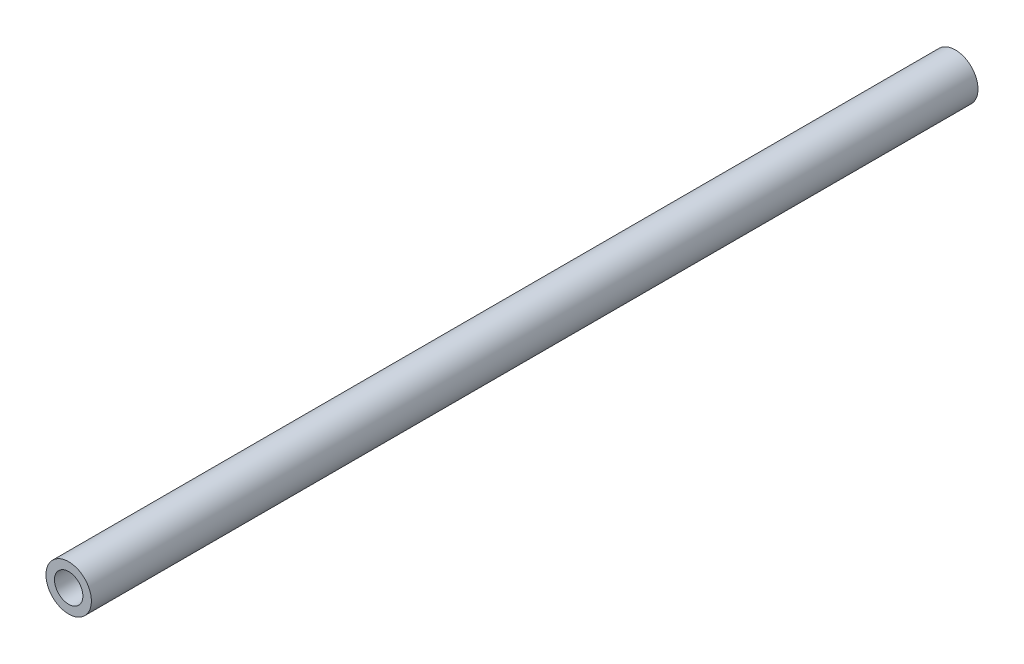
ISO-10303-21;
HEADER;
FILE_DESCRIPTION(('STEP AP214'),'2;1');
FILE_NAME('part.step','',(''),(''),'','','');
FILE_SCHEMA(('AUTOMOTIVE_DESIGN { 1 0 10303 214 1 1 1 1 }'));
ENDSEC;
DATA;
#1=APPLICATION_CONTEXT('core data for automotive mechanical design processes');
#2=APPLICATION_PROTOCOL_DEFINITION('international standard','automotive_design',2000,#1);
#3=PRODUCT_CONTEXT('',#1,'mechanical');
#4=PRODUCT('Part','Part','',(#3));
#5=PRODUCT_RELATED_PRODUCT_CATEGORY('part','',(#4));
#6=PRODUCT_DEFINITION_FORMATION('','',#4);
#7=PRODUCT_DEFINITION_CONTEXT('part definition',#1,'design');
#8=PRODUCT_DEFINITION('design','',#6,#7);
#9=PRODUCT_DEFINITION_SHAPE('','',#8);
#10=(LENGTH_UNIT() NAMED_UNIT(*) SI_UNIT(.MILLI.,.METRE.));
#11=(NAMED_UNIT(*) PLANE_ANGLE_UNIT() SI_UNIT($,.RADIAN.));
#12=(NAMED_UNIT(*) SI_UNIT($,.STERADIAN.) SOLID_ANGLE_UNIT());
#13=UNCERTAINTY_MEASURE_WITH_UNIT(LENGTH_MEASURE(1.E-05),#10,'distance_accuracy_value','');
#14=(GEOMETRIC_REPRESENTATION_CONTEXT(3) GLOBAL_UNCERTAINTY_ASSIGNED_CONTEXT((#13)) GLOBAL_UNIT_ASSIGNED_CONTEXT((#10,
#11,#12)) REPRESENTATION_CONTEXT('',''));
#15=CARTESIAN_POINT('',(0.,0.,0.));
#16=DIRECTION('',(0.,0.,1.));
#17=DIRECTION('',(1.,0.,0.));
#18=AXIS2_PLACEMENT_3D('',#15,#16,#17);
#19=CARTESIAN_POINT('',(0.,0.,61.976));
#20=DIRECTION('',(0.,0.,-1.));
#21=DIRECTION('',(-1.,0.,0.));
#22=AXIS2_PLACEMENT_3D('',#19,#20,#21);
#23=CYLINDRICAL_SURFACE('',#22,1.5875);
#24=CARTESIAN_POINT('',(0.,0.,61.976));
#25=DIRECTION('',(0.,0.,1.));
#26=DIRECTION('',(1.,0.,0.));
#27=AXIS2_PLACEMENT_3D('',#24,#25,#26);
#28=CIRCLE('',#27,1.5875);
#29=CARTESIAN_POINT('',(1.5875,0.,61.976));
#30=VERTEX_POINT('',#29);
#31=EDGE_CURVE('E10',#30,#30,#28,.T.);
#32=ORIENTED_EDGE('',*,*,#31,.F.);
#33=EDGE_LOOP('',(#32));
#34=FACE_BOUND('',#33,.T.);
#35=CARTESIAN_POINT('',(0.,0.,0.));
#36=DIRECTION('',(0.,0.,1.));
#37=DIRECTION('',(1.,0.,0.));
#38=AXIS2_PLACEMENT_3D('',#35,#36,#37);
#39=CIRCLE('',#38,1.5875);
#40=CARTESIAN_POINT('',(1.5875,0.,0.));
#41=VERTEX_POINT('',#40);
#42=EDGE_CURVE('E36',#41,#41,#39,.T.);
#43=ORIENTED_EDGE('',*,*,#42,.T.);
#44=EDGE_LOOP('',(#43));
#45=FACE_BOUND('',#44,.T.);
#46=ADVANCED_FACE('F33',(#34,#45),#23,.T.);
#47=CARTESIAN_POINT('',(0.,0.,61.976));
#48=DIRECTION('',(0.,0.,1.));
#49=DIRECTION('',(1.,0.,0.));
#50=AXIS2_PLACEMENT_3D('',#47,#48,#49);
#51=PLANE('',#50);
#52=CARTESIAN_POINT('',(0.,0.,61.976));
#53=DIRECTION('',(0.,0.,1.));
#54=DIRECTION('',(1.,0.,0.));
#55=AXIS2_PLACEMENT_3D('',#52,#53,#54);
#56=CIRCLE('',#55,0.9921875);
#57=CARTESIAN_POINT('',(0.9921875,0.,61.976));
#58=VERTEX_POINT('',#57);
#59=EDGE_CURVE('E47',#58,#58,#56,.T.);
#60=ORIENTED_EDGE('',*,*,#59,.F.);
#61=EDGE_LOOP('',(#60));
#62=FACE_BOUND('',#61,.T.);
#63=ORIENTED_EDGE('',*,*,#31,.T.);
#64=EDGE_LOOP('',(#63));
#65=FACE_BOUND('',#64,.T.);
#66=ADVANCED_FACE('F54',(#62,#65),#51,.T.);
#67=CARTESIAN_POINT('',(0.,0.,0.));
#68=DIRECTION('',(0.,0.,1.));
#69=DIRECTION('',(1.,0.,0.));
#70=AXIS2_PLACEMENT_3D('',#67,#68,#69);
#71=PLANE('',#70);
#72=CARTESIAN_POINT('',(0.,0.,0.));
#73=DIRECTION('',(0.,0.,1.));
#74=DIRECTION('',(1.,0.,0.));
#75=AXIS2_PLACEMENT_3D('',#72,#73,#74);
#76=CIRCLE('',#75,0.9921875);
#77=CARTESIAN_POINT('',(0.9921875,0.,0.));
#78=VERTEX_POINT('',#77);
#79=EDGE_CURVE('E43',#78,#78,#76,.F.);
#80=ORIENTED_EDGE('',*,*,#79,.F.);
#81=EDGE_LOOP('',(#80));
#82=FACE_BOUND('',#81,.T.);
#83=ORIENTED_EDGE('',*,*,#42,.F.);
#84=EDGE_LOOP('',(#83));
#85=FACE_BOUND('',#84,.T.);
#86=ADVANCED_FACE('F56',(#82,#85),#71,.F.);
#87=CARTESIAN_POINT('',(0.,0.,-0.001000000000001));
#88=DIRECTION('',(0.,0.,1.));
#89=DIRECTION('',(1.,0.,0.));
#90=AXIS2_PLACEMENT_3D('',#87,#88,#89);
#91=CYLINDRICAL_SURFACE('',#90,0.9921875);
#92=ORIENTED_EDGE('',*,*,#59,.T.);
#93=EDGE_LOOP('',(#92));
#94=FACE_BOUND('',#93,.T.);
#95=ORIENTED_EDGE('',*,*,#79,.T.);
#96=EDGE_LOOP('',(#95));
#97=FACE_BOUND('',#96,.T.);
#98=ADVANCED_FACE('F51',(#94,#97),#91,.F.);
#99=CLOSED_SHELL('',(#46,#66,#86,#98));
#100=MANIFOLD_SOLID_BREP('B2',#99);
#101=ADVANCED_BREP_SHAPE_REPRESENTATION('',(#18,#100),#14);
#102=SHAPE_DEFINITION_REPRESENTATION(#9,#101);
ENDSEC;
END-ISO-10303-21;
